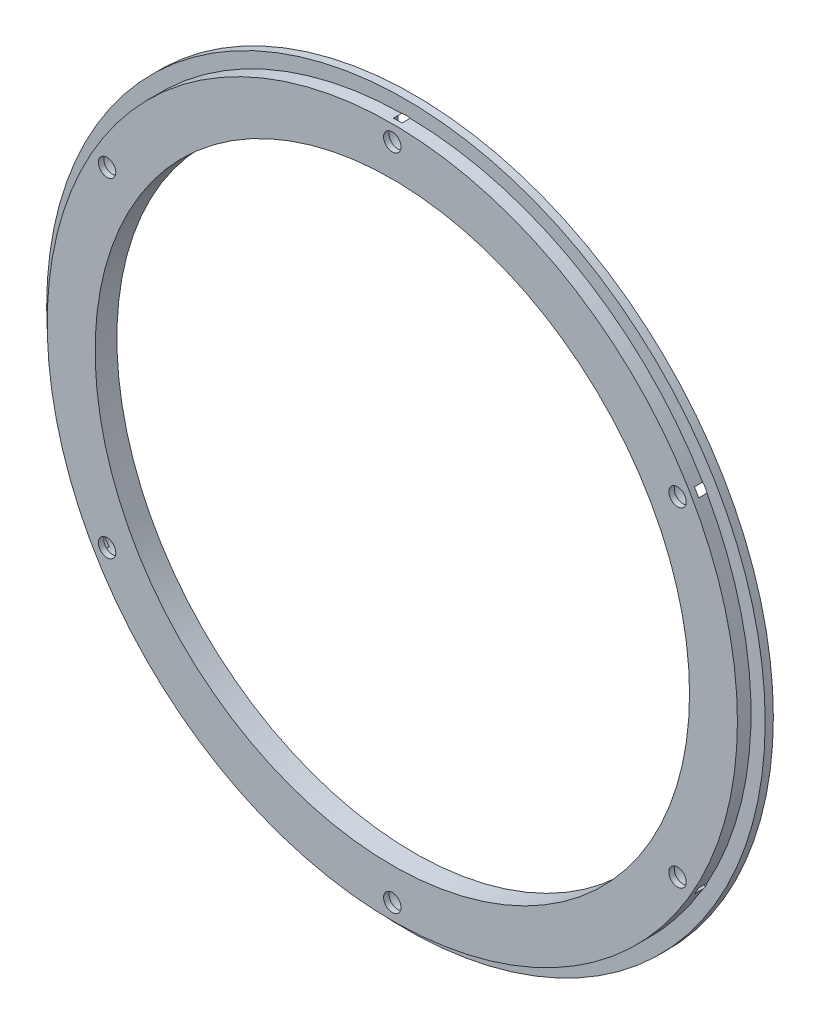
ISO-10303-21;
HEADER;
FILE_DESCRIPTION(('STEP AP214'),'2;1');
FILE_NAME('part.step','',(''),(''),'','','');
FILE_SCHEMA(('AUTOMOTIVE_DESIGN { 1 0 10303 214 1 1 1 1 }'));
ENDSEC;
DATA;
#1=APPLICATION_CONTEXT('core data for automotive mechanical design processes');
#2=APPLICATION_PROTOCOL_DEFINITION('international standard','automotive_design',2000,#1);
#3=PRODUCT_CONTEXT('',#1,'mechanical');
#4=PRODUCT('Part','Part','',(#3));
#5=PRODUCT_RELATED_PRODUCT_CATEGORY('part','',(#4));
#6=PRODUCT_DEFINITION_FORMATION('','',#4);
#7=PRODUCT_DEFINITION_CONTEXT('part definition',#1,'design');
#8=PRODUCT_DEFINITION('design','',#6,#7);
#9=PRODUCT_DEFINITION_SHAPE('','',#8);
#10=(LENGTH_UNIT() NAMED_UNIT(*) SI_UNIT(.MILLI.,.METRE.));
#11=(NAMED_UNIT(*) PLANE_ANGLE_UNIT() SI_UNIT($,.RADIAN.));
#12=(NAMED_UNIT(*) SI_UNIT($,.STERADIAN.) SOLID_ANGLE_UNIT());
#13=UNCERTAINTY_MEASURE_WITH_UNIT(LENGTH_MEASURE(1.E-05),#10,'distance_accuracy_value','');
#14=(GEOMETRIC_REPRESENTATION_CONTEXT(3) GLOBAL_UNCERTAINTY_ASSIGNED_CONTEXT((#13)) GLOBAL_UNIT_ASSIGNED_CONTEXT((#10,
#11,#12)) REPRESENTATION_CONTEXT('',''));
#15=CARTESIAN_POINT('',(0.,0.,0.));
#16=DIRECTION('',(0.,0.,1.));
#17=DIRECTION('',(1.,0.,0.));
#18=AXIS2_PLACEMENT_3D('',#15,#16,#17);
#19=CARTESIAN_POINT('',(52.3945369289602,30.250000000003,-6.));
#20=DIRECTION('',(0.,0.,1.));
#21=DIRECTION('',(1.,0.,0.));
#22=AXIS2_PLACEMENT_3D('',#19,#20,#21);
#23=CYLINDRICAL_SURFACE('',#22,1.60000000000092);
#24=CARTESIAN_POINT('',(52.3945369289602,30.250000000003,4.));
#25=DIRECTION('',(0.,0.,1.));
#26=DIRECTION('',(1.,0.,0.));
#27=AXIS2_PLACEMENT_3D('',#24,#25,#26);
#28=CIRCLE('',#27,1.60000000000092);
#29=CARTESIAN_POINT('',(53.9945369289612,30.250000000003,4.));
#30=VERTEX_POINT('',#29);
#31=EDGE_CURVE('E289',#30,#30,#28,.T.);
#32=ORIENTED_EDGE('',*,*,#31,.T.);
#33=EDGE_LOOP('',(#32));
#34=FACE_BOUND('',#33,.T.);
#35=CARTESIAN_POINT('',(52.3945369289602,30.250000000003,3.));
#36=DIRECTION('',(0.,0.,-1.));
#37=DIRECTION('',(-1.,0.,0.));
#38=AXIS2_PLACEMENT_3D('',#35,#36,#37);
#39=CIRCLE('',#38,1.60000000000092);
#40=CARTESIAN_POINT('',(50.7945369289593,30.250000000003,3.));
#41=VERTEX_POINT('',#40);
#42=EDGE_CURVE('E239',#41,#41,#39,.F.);
#43=ORIENTED_EDGE('',*,*,#42,.F.);
#44=EDGE_LOOP('',(#43));
#45=FACE_BOUND('',#44,.T.);
#46=ADVANCED_FACE('F38',(#34,#45),#23,.F.);
#47=CARTESIAN_POINT('',(52.3945369289637,-30.249999999997,-6.));
#48=DIRECTION('',(0.,0.,1.));
#49=DIRECTION('',(1.,0.,0.));
#50=AXIS2_PLACEMENT_3D('',#47,#48,#49);
#51=CYLINDRICAL_SURFACE('',#50,1.60000000000433);
#52=CARTESIAN_POINT('',(52.3945369289637,-30.249999999997,4.));
#53=DIRECTION('',(0.,0.,1.));
#54=DIRECTION('',(1.,0.,0.));
#55=AXIS2_PLACEMENT_3D('',#52,#53,#54);
#56=CIRCLE('',#55,1.60000000000433);
#57=CARTESIAN_POINT('',(53.994536928968,-30.249999999997,4.));
#58=VERTEX_POINT('',#57);
#59=EDGE_CURVE('E297',#58,#58,#56,.T.);
#60=ORIENTED_EDGE('',*,*,#59,.T.);
#61=EDGE_LOOP('',(#60));
#62=FACE_BOUND('',#61,.T.);
#63=CARTESIAN_POINT('',(52.3945369289637,-30.249999999997,3.));
#64=DIRECTION('',(0.,0.,-1.));
#65=DIRECTION('',(-1.,0.,0.));
#66=AXIS2_PLACEMENT_3D('',#63,#64,#65);
#67=CIRCLE('',#66,1.60000000000433);
#68=CARTESIAN_POINT('',(50.7945369289594,-30.249999999997,3.));
#69=VERTEX_POINT('',#68);
#70=EDGE_CURVE('E234',#69,#69,#67,.F.);
#71=ORIENTED_EDGE('',*,*,#70,.F.);
#72=EDGE_LOOP('',(#71));
#73=FACE_BOUND('',#72,.T.);
#74=ADVANCED_FACE('F334',(#62,#73),#51,.F.);
#75=CARTESIAN_POINT('',(6.85582634275325E-12,-60.5,-6.));
#76=DIRECTION('',(0.,0.,1.));
#77=DIRECTION('',(1.,0.,0.));
#78=AXIS2_PLACEMENT_3D('',#75,#76,#77);
#79=CYLINDRICAL_SURFACE('',#78,1.60000000000696);
#80=CARTESIAN_POINT('',(6.85582634275325E-12,-60.5,4.));
#81=DIRECTION('',(0.,0.,1.));
#82=DIRECTION('',(1.,0.,0.));
#83=AXIS2_PLACEMENT_3D('',#80,#81,#82);
#84=CIRCLE('',#83,1.60000000000696);
#85=CARTESIAN_POINT('',(1.60000000001381,-60.5,4.));
#86=VERTEX_POINT('',#85);
#87=EDGE_CURVE('E301',#86,#86,#84,.T.);
#88=ORIENTED_EDGE('',*,*,#87,.T.);
#89=EDGE_LOOP('',(#88));
#90=FACE_BOUND('',#89,.T.);
#91=CARTESIAN_POINT('',(6.85582634275325E-12,-60.5,3.));
#92=DIRECTION('',(0.,0.,-1.));
#93=DIRECTION('',(-1.,0.,0.));
#94=AXIS2_PLACEMENT_3D('',#91,#92,#93);
#95=CIRCLE('',#94,1.60000000000696);
#96=CARTESIAN_POINT('',(-1.6000000000001,-60.5,3.));
#97=VERTEX_POINT('',#96);
#98=EDGE_CURVE('E229',#97,#97,#95,.F.);
#99=ORIENTED_EDGE('',*,*,#98,.F.);
#100=EDGE_LOOP('',(#99));
#101=FACE_BOUND('',#100,.T.);
#102=ADVANCED_FACE('F341',(#90,#101),#79,.F.);
#103=CARTESIAN_POINT('',(-52.3945369289534,-30.250000000003,-6.));
#104=DIRECTION('',(0.,0.,1.));
#105=DIRECTION('',(1.,0.,0.));
#106=AXIS2_PLACEMENT_3D('',#103,#104,#105);
#107=CYLINDRICAL_SURFACE('',#106,1.60000000000635);
#108=CARTESIAN_POINT('',(-52.3945369289534,-30.250000000003,4.));
#109=DIRECTION('',(0.,0.,1.));
#110=DIRECTION('',(1.,0.,0.));
#111=AXIS2_PLACEMENT_3D('',#108,#109,#110);
#112=CIRCLE('',#111,1.60000000000635);
#113=CARTESIAN_POINT('',(-50.794536928947,-30.250000000003,4.));
#114=VERTEX_POINT('',#113);
#115=EDGE_CURVE('E293',#114,#114,#112,.T.);
#116=ORIENTED_EDGE('',*,*,#115,.T.);
#117=EDGE_LOOP('',(#116));
#118=FACE_BOUND('',#117,.T.);
#119=CARTESIAN_POINT('',(-52.3945369289534,-30.250000000003,3.));
#120=DIRECTION('',(0.,0.,-1.));
#121=DIRECTION('',(-1.,0.,0.));
#122=AXIS2_PLACEMENT_3D('',#119,#120,#121);
#123=CIRCLE('',#122,1.60000000000635);
#124=CARTESIAN_POINT('',(-53.9945369289597,-30.250000000003,3.));
#125=VERTEX_POINT('',#124);
#126=EDGE_CURVE('E225',#125,#125,#123,.F.);
#127=ORIENTED_EDGE('',*,*,#126,.F.);
#128=EDGE_LOOP('',(#127));
#129=FACE_BOUND('',#128,.T.);
#130=ADVANCED_FACE('F351',(#118,#129),#107,.F.);
#131=CARTESIAN_POINT('',(-52.3945369289568,30.249999999997,-6.));
#132=DIRECTION('',(0.,0.,1.));
#133=DIRECTION('',(1.,0.,0.));
#134=AXIS2_PLACEMENT_3D('',#131,#132,#133);
#135=CYLINDRICAL_SURFACE('',#134,1.60000000000322);
#136=CARTESIAN_POINT('',(-52.3945369289568,30.249999999997,4.));
#137=DIRECTION('',(0.,0.,1.));
#138=DIRECTION('',(1.,0.,0.));
#139=AXIS2_PLACEMENT_3D('',#136,#137,#138);
#140=CIRCLE('',#139,1.60000000000322);
#141=CARTESIAN_POINT('',(-50.7945369289536,30.249999999997,4.));
#142=VERTEX_POINT('',#141);
#143=EDGE_CURVE('E283',#142,#142,#140,.T.);
#144=ORIENTED_EDGE('',*,*,#143,.T.);
#145=EDGE_LOOP('',(#144));
#146=FACE_BOUND('',#145,.T.);
#147=CARTESIAN_POINT('',(-52.3945369289568,30.249999999997,3.));
#148=DIRECTION('',(0.,0.,-1.));
#149=DIRECTION('',(-1.,0.,0.));
#150=AXIS2_PLACEMENT_3D('',#147,#148,#149);
#151=CIRCLE('',#150,1.60000000000322);
#152=CARTESIAN_POINT('',(-53.9945369289601,30.249999999997,3.));
#153=VERTEX_POINT('',#152);
#154=EDGE_CURVE('E136',#153,#153,#151,.F.);
#155=ORIENTED_EDGE('',*,*,#154,.F.);
#156=EDGE_LOOP('',(#155));
#157=FACE_BOUND('',#156,.T.);
#158=ADVANCED_FACE('F346',(#146,#157),#135,.F.);
#159=CARTESIAN_POINT('',(0.,60.5,-6.));
#160=DIRECTION('',(0.,0.,1.));
#161=DIRECTION('',(1.,0.,0.));
#162=AXIS2_PLACEMENT_3D('',#159,#160,#161);
#163=CYLINDRICAL_SURFACE('',#162,1.6);
#164=CARTESIAN_POINT('',(0.,60.5,4.));
#165=DIRECTION('',(0.,0.,1.));
#166=DIRECTION('',(1.,0.,0.));
#167=AXIS2_PLACEMENT_3D('',#164,#165,#166);
#168=CIRCLE('',#167,1.6);
#169=CARTESIAN_POINT('',(1.6,60.5,4.));
#170=VERTEX_POINT('',#169);
#171=EDGE_CURVE('E284',#170,#170,#168,.T.);
#172=ORIENTED_EDGE('',*,*,#171,.T.);
#173=EDGE_LOOP('',(#172));
#174=FACE_BOUND('',#173,.T.);
#175=CARTESIAN_POINT('',(0.,60.5,3.));
#176=DIRECTION('',(0.,0.,-1.));
#177=DIRECTION('',(-1.,0.,0.));
#178=AXIS2_PLACEMENT_3D('',#175,#176,#177);
#179=CIRCLE('',#178,1.6);
#180=CARTESIAN_POINT('',(-1.6,60.5,3.));
#181=VERTEX_POINT('',#180);
#182=EDGE_CURVE('E137',#181,#181,#179,.F.);
#183=ORIENTED_EDGE('',*,*,#182,.F.);
#184=EDGE_LOOP('',(#183));
#185=FACE_BOUND('',#184,.T.);
#186=ADVANCED_FACE('F391',(#174,#185),#163,.F.);
#187=CARTESIAN_POINT('',(0.,0.,1.5));
#188=DIRECTION('',(0.,0.,-1.));
#189=DIRECTION('',(-1.,0.,0.));
#190=AXIS2_PLACEMENT_3D('',#187,#188,#189);
#191=CYLINDRICAL_SURFACE('',#190,66.);
#192=CARTESIAN_POINT('',(0.,0.,1.5));
#193=DIRECTION('',(0.,0.,1.));
#194=DIRECTION('',(1.,0.,0.));
#195=AXIS2_PLACEMENT_3D('',#192,#193,#194);
#196=CIRCLE('',#195,66.);
#197=CARTESIAN_POINT('',(66.,0.,1.5));
#198=VERTEX_POINT('',#197);
#199=EDGE_CURVE('E207',#198,#198,#196,.T.);
#200=ORIENTED_EDGE('',*,*,#199,.F.);
#201=EDGE_LOOP('',(#200));
#202=FACE_BOUND('',#201,.T.);
#203=CARTESIAN_POINT('',(0.,0.,0.));
#204=DIRECTION('',(0.,0.,1.));
#205=DIRECTION('',(1.,0.,0.));
#206=AXIS2_PLACEMENT_3D('',#203,#204,#205);
#207=CIRCLE('',#206,66.);
#208=CARTESIAN_POINT('',(66.,0.,0.));
#209=VERTEX_POINT('',#208);
#210=EDGE_CURVE('E213',#209,#209,#207,.T.);
#211=ORIENTED_EDGE('',*,*,#210,.T.);
#212=EDGE_LOOP('',(#211));
#213=FACE_BOUND('',#212,.T.);
#214=ADVANCED_FACE('F40',(#202,#213),#191,.T.);
#215=CARTESIAN_POINT('',(0.,0.,1.5));
#216=DIRECTION('',(0.,0.,1.));
#217=DIRECTION('',(1.,0.,0.));
#218=AXIS2_PLACEMENT_3D('',#215,#216,#217);
#219=PLANE('',#218);
#220=CARTESIAN_POINT('',(-52.3945369289534,-30.250000000003,1.5));
#221=DIRECTION('',(0.,0.,1.));
#222=DIRECTION('',(1.,0.,0.));
#223=AXIS2_PLACEMENT_3D('',#220,#221,#222);
#224=CIRCLE('',#223,3.);
#225=CARTESIAN_POINT('',(-55.2949345012712,-31.0166119764897,1.5));
#226=VERTEX_POINT('',#225);
#227=CARTESIAN_POINT('',(-54.5086411615948,-32.378511990462,1.5));
#228=VERTEX_POINT('',#227);
#229=EDGE_CURVE('E191',#226,#228,#224,.T.);
#230=ORIENTED_EDGE('',*,*,#229,.F.);
#231=CARTESIAN_POINT('',(0.,0.,1.5));
#232=DIRECTION('',(0.,0.,1.));
#233=DIRECTION('',(1.,0.,0.));
#234=AXIS2_PLACEMENT_3D('',#231,#232,#233);
#235=CIRCLE('',#234,63.4);
#236=CARTESIAN_POINT('',(-55.2949345012748,31.0166119764834,1.5));
#237=VERTEX_POINT('',#236);
#238=EDGE_CURVE('E195',#237,#226,#235,.T.);
#239=ORIENTED_EDGE('',*,*,#238,.F.);
#240=CARTESIAN_POINT('',(-52.3945369289568,30.249999999997,1.5));
#241=DIRECTION('',(0.,0.,1.));
#242=DIRECTION('',(1.,0.,0.));
#243=AXIS2_PLACEMENT_3D('',#240,#241,#242);
#244=CIRCLE('',#243,3.);
#245=CARTESIAN_POINT('',(-54.5086411615985,32.3785119904557,1.5));
#246=VERTEX_POINT('',#245);
#247=EDGE_CURVE('E264',#246,#237,#244,.T.);
#248=ORIENTED_EDGE('',*,*,#247,.F.);
#249=CARTESIAN_POINT('',(-0.786293339687857,63.3951239669421,1.5));
#250=VERTEX_POINT('',#249);
#251=EDGE_CURVE('E200',#250,#246,#235,.T.);
#252=ORIENTED_EDGE('',*,*,#251,.F.);
#253=CARTESIAN_POINT('',(0.,60.5,1.5));
#254=DIRECTION('',(0.,0.,1.));
#255=DIRECTION('',(1.,0.,0.));
#256=AXIS2_PLACEMENT_3D('',#253,#254,#255);
#257=CIRCLE('',#256,3.);
#258=CARTESIAN_POINT('',(0.78629333968787,63.3951239669422,1.5));
#259=VERTEX_POINT('',#258);
#260=EDGE_CURVE('E267',#259,#250,#257,.T.);
#261=ORIENTED_EDGE('',*,*,#260,.F.);
#262=CARTESIAN_POINT('',(54.5086411615846,32.3785119904792,1.5));
#263=VERTEX_POINT('',#262);
#264=EDGE_CURVE('E154',#263,#259,#235,.T.);
#265=ORIENTED_EDGE('',*,*,#264,.F.);
#266=CARTESIAN_POINT('',(52.3945369289602,30.250000000003,1.5));
#267=DIRECTION('',(0.,0.,1.));
#268=DIRECTION('',(1.,0.,0.));
#269=AXIS2_PLACEMENT_3D('',#266,#267,#268);
#270=CIRCLE('',#269,3.);
#271=CARTESIAN_POINT('',(55.2949345012846,31.0166119764659,1.5));
#272=VERTEX_POINT('',#271);
#273=EDGE_CURVE('E268',#272,#263,#270,.T.);
#274=ORIENTED_EDGE('',*,*,#273,.F.);
#275=CARTESIAN_POINT('',(55.2949345012876,-31.0166119764605,1.5));
#276=VERTEX_POINT('',#275);
#277=EDGE_CURVE('E202',#276,#272,#235,.T.);
#278=ORIENTED_EDGE('',*,*,#277,.F.);
#279=CARTESIAN_POINT('',(52.3945369289637,-30.249999999997,1.5));
#280=DIRECTION('',(0.,0.,1.));
#281=DIRECTION('',(1.,0.,0.));
#282=AXIS2_PLACEMENT_3D('',#279,#280,#281);
#283=CIRCLE('',#282,3.);
#284=CARTESIAN_POINT('',(54.5086411615888,-32.3785119904721,1.5));
#285=VERTEX_POINT('',#284);
#286=EDGE_CURVE('E272',#285,#276,#283,.T.);
#287=ORIENTED_EDGE('',*,*,#286,.F.);
#288=CARTESIAN_POINT('',(0.786293339695041,-63.395123966942,1.5));
#289=VERTEX_POINT('',#288);
#290=EDGE_CURVE('E196',#289,#285,#235,.T.);
#291=ORIENTED_EDGE('',*,*,#290,.F.);
#292=CARTESIAN_POINT('',(6.85582634275325E-12,-60.5,1.5));
#293=DIRECTION('',(0.,0.,1.));
#294=DIRECTION('',(1.,0.,0.));
#295=AXIS2_PLACEMENT_3D('',#292,#293,#294);
#296=CIRCLE('',#295,3.);
#297=CARTESIAN_POINT('',(-0.786293339680686,-63.3951239669422,1.5));
#298=VERTEX_POINT('',#297);
#299=EDGE_CURVE('E193',#298,#289,#296,.T.);
#300=ORIENTED_EDGE('',*,*,#299,.F.);
#301=EDGE_CURVE('E182',#228,#298,#235,.T.);
#302=ORIENTED_EDGE('',*,*,#301,.F.);
#303=EDGE_LOOP('',(#230,#239,#248,#252,#261,#265,#274,#278,#287,#291,#300,#302));
#304=FACE_BOUND('',#303,.T.);
#305=ORIENTED_EDGE('',*,*,#199,.T.);
#306=EDGE_LOOP('',(#305));
#307=FACE_BOUND('',#306,.T.);
#308=ADVANCED_FACE('F188',(#304,#307),#219,.T.);
#309=CARTESIAN_POINT('',(0.,0.,0.));
#310=DIRECTION('',(0.,0.,1.));
#311=DIRECTION('',(1.,0.,0.));
#312=AXIS2_PLACEMENT_3D('',#309,#310,#311);
#313=PLANE('',#312);
#314=CARTESIAN_POINT('',(-52.3945369289534,-30.250000000003,0.));
#315=DIRECTION('',(0.,0.,-1.));
#316=DIRECTION('',(-1.,0.,0.));
#317=AXIS2_PLACEMENT_3D('',#314,#315,#316);
#318=CIRCLE('',#317,3.);
#319=CARTESIAN_POINT('',(-55.3945369289534,-30.250000000003,0.));
#320=VERTEX_POINT('',#319);
#321=EDGE_CURVE('E467',#320,#320,#318,.T.);
#322=ORIENTED_EDGE('',*,*,#321,.F.);
#323=EDGE_LOOP('',(#322));
#324=FACE_BOUND('',#323,.T.);
#325=CARTESIAN_POINT('',(6.85582634275325E-12,-60.5,0.));
#326=DIRECTION('',(0.,0.,-1.));
#327=DIRECTION('',(-1.,0.,0.));
#328=AXIS2_PLACEMENT_3D('',#325,#326,#327);
#329=CIRCLE('',#328,3.);
#330=CARTESIAN_POINT('',(-2.99999999999315,-60.5,0.));
#331=VERTEX_POINT('',#330);
#332=EDGE_CURVE('E454',#331,#331,#329,.T.);
#333=ORIENTED_EDGE('',*,*,#332,.F.);
#334=EDGE_LOOP('',(#333));
#335=FACE_BOUND('',#334,.T.);
#336=CARTESIAN_POINT('',(52.3945369289637,-30.249999999997,0.));
#337=DIRECTION('',(0.,0.,-1.));
#338=DIRECTION('',(-1.,0.,0.));
#339=AXIS2_PLACEMENT_3D('',#336,#337,#338);
#340=CIRCLE('',#339,3.);
#341=CARTESIAN_POINT('',(49.3945369289637,-30.249999999997,0.));
#342=VERTEX_POINT('',#341);
#343=EDGE_CURVE('E426',#342,#342,#340,.T.);
#344=ORIENTED_EDGE('',*,*,#343,.F.);
#345=EDGE_LOOP('',(#344));
#346=FACE_BOUND('',#345,.T.);
#347=CARTESIAN_POINT('',(0.,60.5,0.));
#348=DIRECTION('',(0.,0.,-1.));
#349=DIRECTION('',(-1.,0.,0.));
#350=AXIS2_PLACEMENT_3D('',#347,#348,#349);
#351=CIRCLE('',#350,3.);
#352=CARTESIAN_POINT('',(-3.,60.5,0.));
#353=VERTEX_POINT('',#352);
#354=EDGE_CURVE('E146',#353,#353,#351,.T.);
#355=ORIENTED_EDGE('',*,*,#354,.F.);
#356=EDGE_LOOP('',(#355));
#357=FACE_BOUND('',#356,.T.);
#358=CARTESIAN_POINT('',(-52.3945369289568,30.249999999997,0.));
#359=DIRECTION('',(0.,0.,-1.));
#360=DIRECTION('',(-1.,0.,0.));
#361=AXIS2_PLACEMENT_3D('',#358,#359,#360);
#362=CIRCLE('',#361,3.);
#363=CARTESIAN_POINT('',(-55.3945369289569,30.249999999997,0.));
#364=VERTEX_POINT('',#363);
#365=EDGE_CURVE('E462',#364,#364,#362,.T.);
#366=ORIENTED_EDGE('',*,*,#365,.F.);
#367=EDGE_LOOP('',(#366));
#368=FACE_BOUND('',#367,.T.);
#369=CARTESIAN_POINT('',(52.3945369289602,30.250000000003,0.));
#370=DIRECTION('',(0.,0.,-1.));
#371=DIRECTION('',(-1.,0.,0.));
#372=AXIS2_PLACEMENT_3D('',#369,#370,#371);
#373=CIRCLE('',#372,3.);
#374=CARTESIAN_POINT('',(49.3945369289602,30.250000000003,0.));
#375=VERTEX_POINT('',#374);
#376=EDGE_CURVE('E145',#375,#375,#373,.T.);
#377=ORIENTED_EDGE('',*,*,#376,.F.);
#378=EDGE_LOOP('',(#377));
#379=FACE_BOUND('',#378,.T.);
#380=CARTESIAN_POINT('',(0.,0.,0.));
#381=DIRECTION('',(0.,0.,1.));
#382=DIRECTION('',(1.,0.,0.));
#383=AXIS2_PLACEMENT_3D('',#380,#381,#382);
#384=CIRCLE('',#383,54.6);
#385=CARTESIAN_POINT('',(54.6,0.,0.));
#386=VERTEX_POINT('',#385);
#387=EDGE_CURVE('E310',#386,#386,#384,.T.);
#388=ORIENTED_EDGE('',*,*,#387,.T.);
#389=EDGE_LOOP('',(#388));
#390=FACE_BOUND('',#389,.T.);
#391=ORIENTED_EDGE('',*,*,#210,.F.);
#392=EDGE_LOOP('',(#391));
#393=FACE_BOUND('',#392,.T.);
#394=ADVANCED_FACE('F321',(#324,#335,#346,#357,#368,#379,#390,#393),#313,.F.);
#395=CARTESIAN_POINT('',(0.,0.,4.));
#396=DIRECTION('',(0.,0.,-1.));
#397=DIRECTION('',(-1.,0.,0.));
#398=AXIS2_PLACEMENT_3D('',#395,#396,#397);
#399=CYLINDRICAL_SURFACE('',#398,63.4);
#400=ORIENTED_EDGE('',*,*,#238,.T.);
#401=DIRECTION('',(0.,0.,-1.));
#402=VECTOR('',#401,1.);
#403=CARTESIAN_POINT('',(-55.2949345012712,-31.0166119764897,1.5));
#404=LINE('',#403,#402);
#405=CARTESIAN_POINT('',(-55.2949345012712,-31.0166119764897,3.));
#406=VERTEX_POINT('',#405);
#407=EDGE_CURVE('E11',#226,#406,#404,.F.);
#408=ORIENTED_EDGE('',*,*,#407,.T.);
#409=CARTESIAN_POINT('',(0.,0.,3.));
#410=DIRECTION('',(0.,0.,-1.));
#411=DIRECTION('',(-1.,0.,0.));
#412=AXIS2_PLACEMENT_3D('',#409,#410,#411);
#413=CIRCLE('',#412,63.4);
#414=CARTESIAN_POINT('',(-54.5086411615948,-32.3785119904619,3.));
#415=VERTEX_POINT('',#414);
#416=EDGE_CURVE('E183',#415,#406,#413,.T.);
#417=ORIENTED_EDGE('',*,*,#416,.F.);
#418=DIRECTION('',(0.,0.,-1.));
#419=VECTOR('',#418,1.);
#420=CARTESIAN_POINT('',(-54.5086411615948,-32.378511990462,1.5));
#421=LINE('',#420,#419);
#422=EDGE_CURVE('E47',#415,#228,#421,.T.);
#423=ORIENTED_EDGE('',*,*,#422,.T.);
#424=ORIENTED_EDGE('',*,*,#301,.T.);
#425=DIRECTION('',(0.,0.,-1.));
#426=VECTOR('',#425,1.);
#427=CARTESIAN_POINT('',(-0.786293339680672,-63.3951239669422,1.5));
#428=LINE('',#427,#426);
#429=CARTESIAN_POINT('',(-0.786293339680462,-63.3951239669422,3.));
#430=VERTEX_POINT('',#429);
#431=EDGE_CURVE('E174',#298,#430,#428,.F.);
#432=ORIENTED_EDGE('',*,*,#431,.T.);
#433=CARTESIAN_POINT('',(0.,0.,3.));
#434=DIRECTION('',(0.,0.,-1.));
#435=DIRECTION('',(-1.,0.,0.));
#436=AXIS2_PLACEMENT_3D('',#433,#434,#435);
#437=CIRCLE('',#436,63.4);
#438=CARTESIAN_POINT('',(0.786293339694826,-63.3951239669421,3.));
#439=VERTEX_POINT('',#438);
#440=EDGE_CURVE('E233',#439,#430,#437,.T.);
#441=ORIENTED_EDGE('',*,*,#440,.F.);
#442=DIRECTION('',(0.,0.,-1.));
#443=VECTOR('',#442,1.);
#444=CARTESIAN_POINT('',(0.786293339695041,-63.395123966942,1.5));
#445=LINE('',#444,#443);
#446=EDGE_CURVE('E170',#439,#289,#445,.T.);
#447=ORIENTED_EDGE('',*,*,#446,.T.);
#448=ORIENTED_EDGE('',*,*,#290,.T.);
#449=DIRECTION('',(0.,0.,-1.));
#450=VECTOR('',#449,1.);
#451=CARTESIAN_POINT('',(54.5086411615888,-32.3785119904722,1.5));
#452=LINE('',#451,#450);
#453=CARTESIAN_POINT('',(54.5086411615887,-32.3785119904723,3.));
#454=VERTEX_POINT('',#453);
#455=EDGE_CURVE('E161',#285,#454,#452,.F.);
#456=ORIENTED_EDGE('',*,*,#455,.T.);
#457=CARTESIAN_POINT('',(0.,0.,3.));
#458=DIRECTION('',(0.,0.,-1.));
#459=DIRECTION('',(-1.,0.,0.));
#460=AXIS2_PLACEMENT_3D('',#457,#458,#459);
#461=CIRCLE('',#460,63.4);
#462=CARTESIAN_POINT('',(55.2949345012877,-31.0166119764604,3.));
#463=VERTEX_POINT('',#462);
#464=EDGE_CURVE('E238',#463,#454,#461,.T.);
#465=ORIENTED_EDGE('',*,*,#464,.F.);
#466=DIRECTION('',(0.,0.,-1.));
#467=VECTOR('',#466,1.);
#468=CARTESIAN_POINT('',(55.2949345012876,-31.0166119764606,1.5));
#469=LINE('',#468,#467);
#470=EDGE_CURVE('E156',#463,#276,#469,.T.);
#471=ORIENTED_EDGE('',*,*,#470,.T.);
#472=ORIENTED_EDGE('',*,*,#277,.T.);
#473=DIRECTION('',(0.,0.,-1.));
#474=VECTOR('',#473,1.);
#475=CARTESIAN_POINT('',(55.2949345012844,31.0166119764658,1.5));
#476=LINE('',#475,#474);
#477=CARTESIAN_POINT('',(55.2949345012842,31.0166119764666,3.));
#478=VERTEX_POINT('',#477);
#479=EDGE_CURVE('E247',#272,#478,#476,.F.);
#480=ORIENTED_EDGE('',*,*,#479,.T.);
#481=CARTESIAN_POINT('',(0.,0.,3.));
#482=DIRECTION('',(0.,0.,-1.));
#483=DIRECTION('',(-1.,0.,0.));
#484=AXIS2_PLACEMENT_3D('',#481,#482,#483);
#485=CIRCLE('',#484,63.4);
#486=CARTESIAN_POINT('',(54.508641161585,32.3785119904785,3.));
#487=VERTEX_POINT('',#486);
#488=EDGE_CURVE('E243',#487,#478,#485,.T.);
#489=ORIENTED_EDGE('',*,*,#488,.F.);
#490=DIRECTION('',(0.,0.,-1.));
#491=VECTOR('',#490,1.);
#492=CARTESIAN_POINT('',(54.5086411615844,32.3785119904791,1.5));
#493=LINE('',#492,#491);
#494=EDGE_CURVE('E244',#487,#263,#493,.T.);
#495=ORIENTED_EDGE('',*,*,#494,.T.);
#496=ORIENTED_EDGE('',*,*,#264,.T.);
#497=DIRECTION('',(0.,0.,-1.));
#498=VECTOR('',#497,1.);
#499=CARTESIAN_POINT('',(0.786293339687855,63.3951239669421,1.5));
#500=LINE('',#499,#498);
#501=CARTESIAN_POINT('',(0.786293339687644,63.3951239669422,3.));
#502=VERTEX_POINT('',#501);
#503=EDGE_CURVE('E141',#259,#502,#500,.F.);
#504=ORIENTED_EDGE('',*,*,#503,.T.);
#505=CARTESIAN_POINT('',(0.,0.,3.));
#506=DIRECTION('',(0.,0.,-1.));
#507=DIRECTION('',(-1.,0.,0.));
#508=AXIS2_PLACEMENT_3D('',#505,#506,#507);
#509=CIRCLE('',#508,63.4);
#510=CARTESIAN_POINT('',(-0.786293339687644,63.3951239669422,3.));
#511=VERTEX_POINT('',#510);
#512=EDGE_CURVE('E127',#511,#502,#509,.T.);
#513=ORIENTED_EDGE('',*,*,#512,.F.);
#514=DIRECTION('',(0.,0.,-1.));
#515=VECTOR('',#514,1.);
#516=CARTESIAN_POINT('',(-0.786293339687855,63.3951239669421,1.5));
#517=LINE('',#516,#515);
#518=EDGE_CURVE('E143',#511,#250,#517,.T.);
#519=ORIENTED_EDGE('',*,*,#518,.T.);
#520=ORIENTED_EDGE('',*,*,#251,.T.);
#521=DIRECTION('',(0.,0.,-1.));
#522=VECTOR('',#521,1.);
#523=CARTESIAN_POINT('',(-54.5086411615985,32.3785119904557,1.5));
#524=LINE('',#523,#522);
#525=CARTESIAN_POINT('',(-54.5086411615986,32.3785119904557,3.));
#526=VERTEX_POINT('',#525);
#527=EDGE_CURVE('E163',#246,#526,#524,.F.);
#528=ORIENTED_EDGE('',*,*,#527,.T.);
#529=CARTESIAN_POINT('',(0.,0.,3.));
#530=DIRECTION('',(0.,0.,-1.));
#531=DIRECTION('',(-1.,0.,0.));
#532=AXIS2_PLACEMENT_3D('',#529,#530,#531);
#533=CIRCLE('',#532,63.4);
#534=CARTESIAN_POINT('',(-55.2949345012747,31.0166119764834,3.));
#535=VERTEX_POINT('',#534);
#536=EDGE_CURVE('E224',#535,#526,#533,.T.);
#537=ORIENTED_EDGE('',*,*,#536,.F.);
#538=DIRECTION('',(0.,0.,-1.));
#539=VECTOR('',#538,1.);
#540=CARTESIAN_POINT('',(-55.2949345012748,31.0166119764834,1.5));
#541=LINE('',#540,#539);
#542=EDGE_CURVE('E251',#535,#237,#541,.T.);
#543=ORIENTED_EDGE('',*,*,#542,.T.);
#544=EDGE_LOOP('',(#400,#408,#417,#423,#424,#432,#441,#447,#448,#456,#465,#471,#472,#480,#489,
#495,#496,#504,#513,#519,#520,#528,#537,#543));
#545=FACE_BOUND('',#544,.T.);
#546=CARTESIAN_POINT('',(0.,0.,4.));
#547=DIRECTION('',(0.,0.,1.));
#548=DIRECTION('',(1.,0.,0.));
#549=AXIS2_PLACEMENT_3D('',#546,#547,#548);
#550=CIRCLE('',#549,63.4);
#551=CARTESIAN_POINT('',(63.4,0.,4.));
#552=VERTEX_POINT('',#551);
#553=EDGE_CURVE('E208',#552,#552,#550,.T.);
#554=ORIENTED_EDGE('',*,*,#553,.F.);
#555=EDGE_LOOP('',(#554));
#556=FACE_BOUND('',#555,.T.);
#557=ADVANCED_FACE('F150',(#545,#556),#399,.T.);
#558=CARTESIAN_POINT('',(0.,0.,4.));
#559=DIRECTION('',(0.,0.,1.));
#560=DIRECTION('',(1.,0.,0.));
#561=AXIS2_PLACEMENT_3D('',#558,#559,#560);
#562=PLANE('',#561);
#563=ORIENTED_EDGE('',*,*,#171,.F.);
#564=EDGE_LOOP('',(#563));
#565=FACE_BOUND('',#564,.T.);
#566=ORIENTED_EDGE('',*,*,#143,.F.);
#567=EDGE_LOOP('',(#566));
#568=FACE_BOUND('',#567,.T.);
#569=ORIENTED_EDGE('',*,*,#115,.F.);
#570=EDGE_LOOP('',(#569));
#571=FACE_BOUND('',#570,.T.);
#572=ORIENTED_EDGE('',*,*,#87,.F.);
#573=EDGE_LOOP('',(#572));
#574=FACE_BOUND('',#573,.T.);
#575=ORIENTED_EDGE('',*,*,#59,.F.);
#576=EDGE_LOOP('',(#575));
#577=FACE_BOUND('',#576,.T.);
#578=ORIENTED_EDGE('',*,*,#31,.F.);
#579=EDGE_LOOP('',(#578));
#580=FACE_BOUND('',#579,.T.);
#581=CARTESIAN_POINT('',(0.,0.,4.));
#582=DIRECTION('',(0.,0.,1.));
#583=DIRECTION('',(1.,0.,0.));
#584=AXIS2_PLACEMENT_3D('',#581,#582,#583);
#585=CIRCLE('',#584,54.6);
#586=CARTESIAN_POINT('',(54.6,0.,4.));
#587=VERTEX_POINT('',#586);
#588=EDGE_CURVE('E288',#587,#587,#585,.T.);
#589=ORIENTED_EDGE('',*,*,#588,.F.);
#590=EDGE_LOOP('',(#589));
#591=FACE_BOUND('',#590,.T.);
#592=ORIENTED_EDGE('',*,*,#553,.T.);
#593=EDGE_LOOP('',(#592));
#594=FACE_BOUND('',#593,.T.);
#595=ADVANCED_FACE('F319',(#565,#568,#571,#574,#577,#580,#591,#594),#562,.T.);
#596=CARTESIAN_POINT('',(0.,0.,-6.));
#597=DIRECTION('',(0.,0.,1.));
#598=DIRECTION('',(1.,0.,0.));
#599=AXIS2_PLACEMENT_3D('',#596,#597,#598);
#600=CYLINDRICAL_SURFACE('',#599,54.6);
#601=ORIENTED_EDGE('',*,*,#588,.T.);
#602=EDGE_LOOP('',(#601));
#603=FACE_BOUND('',#602,.T.);
#604=ORIENTED_EDGE('',*,*,#387,.F.);
#605=EDGE_LOOP('',(#604));
#606=FACE_BOUND('',#605,.T.);
#607=ADVANCED_FACE('F328',(#603,#606),#600,.F.);
#608=CARTESIAN_POINT('',(0.,60.5,3.));
#609=DIRECTION('',(0.,0.,-1.));
#610=DIRECTION('',(-1.,0.,0.));
#611=AXIS2_PLACEMENT_3D('',#608,#609,#610);
#612=CYLINDRICAL_SURFACE('',#611,3.);
#613=ORIENTED_EDGE('',*,*,#354,.T.);
#614=EDGE_LOOP('',(#613));
#615=FACE_BOUND('',#614,.T.);
#616=ORIENTED_EDGE('',*,*,#260,.T.);
#617=ORIENTED_EDGE('',*,*,#518,.F.);
#618=CARTESIAN_POINT('',(0.,60.5,3.));
#619=DIRECTION('',(0.,0.,-1.));
#620=DIRECTION('',(-1.,0.,0.));
#621=AXIS2_PLACEMENT_3D('',#618,#619,#620);
#622=CIRCLE('',#621,3.);
#623=EDGE_CURVE('E130',#502,#511,#622,.T.);
#624=ORIENTED_EDGE('',*,*,#623,.F.);
#625=ORIENTED_EDGE('',*,*,#503,.F.);
#626=EDGE_LOOP('',(#616,#617,#624,#625));
#627=FACE_BOUND('',#626,.T.);
#628=ADVANCED_FACE('F140',(#615,#627),#612,.F.);
#629=CARTESIAN_POINT('',(0.,60.5,3.));
#630=DIRECTION('',(0.,0.,-1.));
#631=DIRECTION('',(-1.,0.,0.));
#632=AXIS2_PLACEMENT_3D('',#629,#630,#631);
#633=PLANE('',#632);
#634=ORIENTED_EDGE('',*,*,#182,.T.);
#635=EDGE_LOOP('',(#634));
#636=FACE_BOUND('',#635,.T.);
#637=ORIENTED_EDGE('',*,*,#512,.T.);
#638=ORIENTED_EDGE('',*,*,#623,.T.);
#639=EDGE_LOOP('',(#637,#638));
#640=FACE_BOUND('',#639,.T.);
#641=ADVANCED_FACE('F129',(#636,#640),#633,.T.);
#642=CARTESIAN_POINT('',(-52.3945369289568,30.249999999997,3.));
#643=DIRECTION('',(0.,0.,-1.));
#644=DIRECTION('',(-1.,0.,0.));
#645=AXIS2_PLACEMENT_3D('',#642,#643,#644);
#646=CYLINDRICAL_SURFACE('',#645,3.);
#647=ORIENTED_EDGE('',*,*,#365,.T.);
#648=EDGE_LOOP('',(#647));
#649=FACE_BOUND('',#648,.T.);
#650=ORIENTED_EDGE('',*,*,#247,.T.);
#651=ORIENTED_EDGE('',*,*,#542,.F.);
#652=CARTESIAN_POINT('',(-52.3945369289568,30.249999999997,3.));
#653=DIRECTION('',(0.,0.,-1.));
#654=DIRECTION('',(-1.,0.,0.));
#655=AXIS2_PLACEMENT_3D('',#652,#653,#654);
#656=CIRCLE('',#655,3.);
#657=EDGE_CURVE('E265',#526,#535,#656,.T.);
#658=ORIENTED_EDGE('',*,*,#657,.F.);
#659=ORIENTED_EDGE('',*,*,#527,.F.);
#660=EDGE_LOOP('',(#650,#651,#658,#659));
#661=FACE_BOUND('',#660,.T.);
#662=ADVANCED_FACE('F262',(#649,#661),#646,.F.);
#663=CARTESIAN_POINT('',(-52.3945369289568,30.249999999997,3.));
#664=DIRECTION('',(0.,0.,-1.));
#665=DIRECTION('',(-1.,0.,0.));
#666=AXIS2_PLACEMENT_3D('',#663,#664,#665);
#667=PLANE('',#666);
#668=ORIENTED_EDGE('',*,*,#154,.T.);
#669=EDGE_LOOP('',(#668));
#670=FACE_BOUND('',#669,.T.);
#671=ORIENTED_EDGE('',*,*,#536,.T.);
#672=ORIENTED_EDGE('',*,*,#657,.T.);
#673=EDGE_LOOP('',(#671,#672));
#674=FACE_BOUND('',#673,.T.);
#675=ADVANCED_FACE('F486',(#670,#674),#667,.T.);
#676=CARTESIAN_POINT('',(-52.3945369289534,-30.250000000003,3.));
#677=DIRECTION('',(0.,0.,-1.));
#678=DIRECTION('',(-1.,0.,0.));
#679=AXIS2_PLACEMENT_3D('',#676,#677,#678);
#680=CYLINDRICAL_SURFACE('',#679,3.);
#681=ORIENTED_EDGE('',*,*,#321,.T.);
#682=EDGE_LOOP('',(#681));
#683=FACE_BOUND('',#682,.T.);
#684=ORIENTED_EDGE('',*,*,#229,.T.);
#685=ORIENTED_EDGE('',*,*,#422,.F.);
#686=CARTESIAN_POINT('',(-52.3945369289534,-30.250000000003,3.));
#687=DIRECTION('',(0.,0.,-1.));
#688=DIRECTION('',(-1.,0.,0.));
#689=AXIS2_PLACEMENT_3D('',#686,#687,#688);
#690=CIRCLE('',#689,3.);
#691=EDGE_CURVE('E53',#406,#415,#690,.T.);
#692=ORIENTED_EDGE('',*,*,#691,.F.);
#693=ORIENTED_EDGE('',*,*,#407,.F.);
#694=EDGE_LOOP('',(#684,#685,#692,#693));
#695=FACE_BOUND('',#694,.T.);
#696=ADVANCED_FACE('F487',(#683,#695),#680,.F.);
#697=CARTESIAN_POINT('',(-52.3945369289534,-30.250000000003,3.));
#698=DIRECTION('',(0.,0.,-1.));
#699=DIRECTION('',(-1.,0.,0.));
#700=AXIS2_PLACEMENT_3D('',#697,#698,#699);
#701=PLANE('',#700);
#702=ORIENTED_EDGE('',*,*,#126,.T.);
#703=EDGE_LOOP('',(#702));
#704=FACE_BOUND('',#703,.T.);
#705=ORIENTED_EDGE('',*,*,#416,.T.);
#706=ORIENTED_EDGE('',*,*,#691,.T.);
#707=EDGE_LOOP('',(#705,#706));
#708=FACE_BOUND('',#707,.T.);
#709=ADVANCED_FACE('F489',(#704,#708),#701,.T.);
#710=CARTESIAN_POINT('',(6.85582634275325E-12,-60.5,3.));
#711=DIRECTION('',(0.,0.,-1.));
#712=DIRECTION('',(-1.,0.,0.));
#713=AXIS2_PLACEMENT_3D('',#710,#711,#712);
#714=CYLINDRICAL_SURFACE('',#713,3.);
#715=ORIENTED_EDGE('',*,*,#332,.T.);
#716=EDGE_LOOP('',(#715));
#717=FACE_BOUND('',#716,.T.);
#718=ORIENTED_EDGE('',*,*,#299,.T.);
#719=ORIENTED_EDGE('',*,*,#446,.F.);
#720=CARTESIAN_POINT('',(6.85582634275325E-12,-60.5,3.));
#721=DIRECTION('',(0.,0.,-1.));
#722=DIRECTION('',(-1.,0.,0.));
#723=AXIS2_PLACEMENT_3D('',#720,#721,#722);
#724=CIRCLE('',#723,3.);
#725=EDGE_CURVE('E60',#430,#439,#724,.T.);
#726=ORIENTED_EDGE('',*,*,#725,.F.);
#727=ORIENTED_EDGE('',*,*,#431,.F.);
#728=EDGE_LOOP('',(#718,#719,#726,#727));
#729=FACE_BOUND('',#728,.T.);
#730=ADVANCED_FACE('F452',(#717,#729),#714,.F.);
#731=CARTESIAN_POINT('',(6.85582634275325E-12,-60.5,3.));
#732=DIRECTION('',(0.,0.,-1.));
#733=DIRECTION('',(-1.,0.,0.));
#734=AXIS2_PLACEMENT_3D('',#731,#732,#733);
#735=PLANE('',#734);
#736=ORIENTED_EDGE('',*,*,#98,.T.);
#737=EDGE_LOOP('',(#736));
#738=FACE_BOUND('',#737,.T.);
#739=ORIENTED_EDGE('',*,*,#440,.T.);
#740=ORIENTED_EDGE('',*,*,#725,.T.);
#741=EDGE_LOOP('',(#739,#740));
#742=FACE_BOUND('',#741,.T.);
#743=ADVANCED_FACE('F383',(#738,#742),#735,.T.);
#744=CARTESIAN_POINT('',(52.3945369289637,-30.249999999997,3.));
#745=DIRECTION('',(0.,0.,-1.));
#746=DIRECTION('',(-1.,0.,0.));
#747=AXIS2_PLACEMENT_3D('',#744,#745,#746);
#748=CYLINDRICAL_SURFACE('',#747,3.);
#749=ORIENTED_EDGE('',*,*,#343,.T.);
#750=EDGE_LOOP('',(#749));
#751=FACE_BOUND('',#750,.T.);
#752=ORIENTED_EDGE('',*,*,#286,.T.);
#753=ORIENTED_EDGE('',*,*,#470,.F.);
#754=CARTESIAN_POINT('',(52.3945369289637,-30.249999999997,3.));
#755=DIRECTION('',(0.,0.,-1.));
#756=DIRECTION('',(-1.,0.,0.));
#757=AXIS2_PLACEMENT_3D('',#754,#755,#756);
#758=CIRCLE('',#757,3.);
#759=EDGE_CURVE('E419',#454,#463,#758,.T.);
#760=ORIENTED_EDGE('',*,*,#759,.F.);
#761=ORIENTED_EDGE('',*,*,#455,.F.);
#762=EDGE_LOOP('',(#752,#753,#760,#761));
#763=FACE_BOUND('',#762,.T.);
#764=ADVANCED_FACE('F379',(#751,#763),#748,.F.);
#765=CARTESIAN_POINT('',(52.3945369289637,-30.249999999997,3.));
#766=DIRECTION('',(0.,0.,-1.));
#767=DIRECTION('',(-1.,0.,0.));
#768=AXIS2_PLACEMENT_3D('',#765,#766,#767);
#769=PLANE('',#768);
#770=ORIENTED_EDGE('',*,*,#70,.T.);
#771=EDGE_LOOP('',(#770));
#772=FACE_BOUND('',#771,.T.);
#773=ORIENTED_EDGE('',*,*,#464,.T.);
#774=ORIENTED_EDGE('',*,*,#759,.T.);
#775=EDGE_LOOP('',(#773,#774));
#776=FACE_BOUND('',#775,.T.);
#777=ADVANCED_FACE('F375',(#772,#776),#769,.T.);
#778=CARTESIAN_POINT('',(52.3945369289602,30.250000000003,3.));
#779=DIRECTION('',(0.,0.,-1.));
#780=DIRECTION('',(-1.,0.,0.));
#781=AXIS2_PLACEMENT_3D('',#778,#779,#780);
#782=CYLINDRICAL_SURFACE('',#781,3.);
#783=ORIENTED_EDGE('',*,*,#376,.T.);
#784=EDGE_LOOP('',(#783));
#785=FACE_BOUND('',#784,.T.);
#786=ORIENTED_EDGE('',*,*,#273,.T.);
#787=ORIENTED_EDGE('',*,*,#494,.F.);
#788=CARTESIAN_POINT('',(52.3945369289602,30.250000000003,3.));
#789=DIRECTION('',(0.,0.,-1.));
#790=DIRECTION('',(-1.,0.,0.));
#791=AXIS2_PLACEMENT_3D('',#788,#789,#790);
#792=CIRCLE('',#791,3.);
#793=EDGE_CURVE('E220',#478,#487,#792,.T.);
#794=ORIENTED_EDGE('',*,*,#793,.F.);
#795=ORIENTED_EDGE('',*,*,#479,.F.);
#796=EDGE_LOOP('',(#786,#787,#794,#795));
#797=FACE_BOUND('',#796,.T.);
#798=ADVANCED_FACE('F378',(#785,#797),#782,.F.);
#799=CARTESIAN_POINT('',(52.3945369289602,30.250000000003,3.));
#800=DIRECTION('',(0.,0.,-1.));
#801=DIRECTION('',(-1.,0.,0.));
#802=AXIS2_PLACEMENT_3D('',#799,#800,#801);
#803=PLANE('',#802);
#804=ORIENTED_EDGE('',*,*,#42,.T.);
#805=EDGE_LOOP('',(#804));
#806=FACE_BOUND('',#805,.T.);
#807=ORIENTED_EDGE('',*,*,#488,.T.);
#808=ORIENTED_EDGE('',*,*,#793,.T.);
#809=EDGE_LOOP('',(#807,#808));
#810=FACE_BOUND('',#809,.T.);
#811=ADVANCED_FACE('F385',(#806,#810),#803,.T.);
#812=CLOSED_SHELL('',(#46,#74,#102,#130,#158,#186,#214,#308,#394,#557,#595,#607,#628,#641,#662,
#675,#696,#709,#730,#743,#764,#777,#798,#811));
#813=MANIFOLD_SOLID_BREP('B2',#812);
#814=ADVANCED_BREP_SHAPE_REPRESENTATION('',(#18,#813),#14);
#815=SHAPE_DEFINITION_REPRESENTATION(#9,#814);
ENDSEC;
END-ISO-10303-21;
